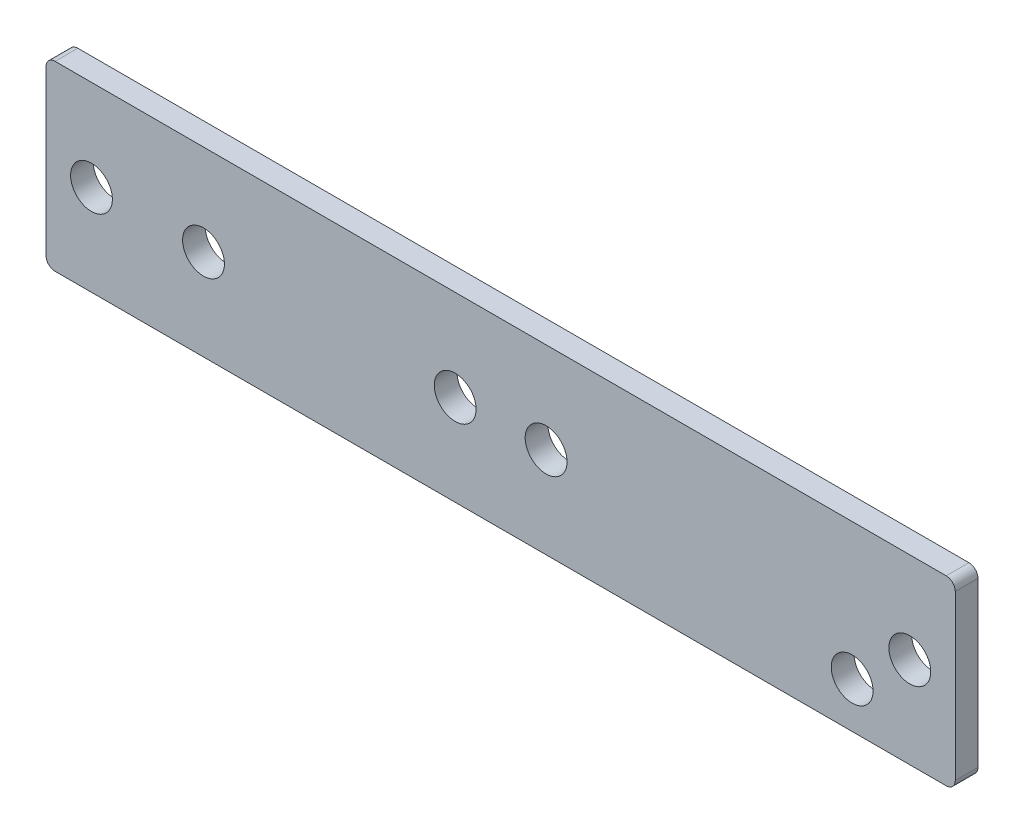
ISO-10303-21;
HEADER;
FILE_DESCRIPTION(('STEP AP214'),'2;1');
FILE_NAME('part.step','',(''),(''),'','','');
FILE_SCHEMA(('AUTOMOTIVE_DESIGN { 1 0 10303 214 1 1 1 1 }'));
ENDSEC;
DATA;
#1=APPLICATION_CONTEXT('core data for automotive mechanical design processes');
#2=APPLICATION_PROTOCOL_DEFINITION('international standard','automotive_design',2000,#1);
#3=PRODUCT_CONTEXT('',#1,'mechanical');
#4=PRODUCT('Part','Part','',(#3));
#5=PRODUCT_RELATED_PRODUCT_CATEGORY('part','',(#4));
#6=PRODUCT_DEFINITION_FORMATION('','',#4);
#7=PRODUCT_DEFINITION_CONTEXT('part definition',#1,'design');
#8=PRODUCT_DEFINITION('design','',#6,#7);
#9=PRODUCT_DEFINITION_SHAPE('','',#8);
#10=(LENGTH_UNIT() NAMED_UNIT(*) SI_UNIT(.MILLI.,.METRE.));
#11=(NAMED_UNIT(*) PLANE_ANGLE_UNIT() SI_UNIT($,.RADIAN.));
#12=(NAMED_UNIT(*) SI_UNIT($,.STERADIAN.) SOLID_ANGLE_UNIT());
#13=UNCERTAINTY_MEASURE_WITH_UNIT(LENGTH_MEASURE(1.E-05),#10,'distance_accuracy_value','');
#14=(GEOMETRIC_REPRESENTATION_CONTEXT(3) GLOBAL_UNCERTAINTY_ASSIGNED_CONTEXT((#13)) GLOBAL_UNIT_ASSIGNED_CONTEXT((#10,
#11,#12)) REPRESENTATION_CONTEXT('',''));
#15=CARTESIAN_POINT('',(0.,0.,0.));
#16=DIRECTION('',(0.,0.,1.));
#17=DIRECTION('',(1.,0.,0.));
#18=AXIS2_PLACEMENT_3D('',#15,#16,#17);
#19=CARTESIAN_POINT('',(-100.,20.,5.));
#20=DIRECTION('',(1.,0.,0.));
#21=DIRECTION('',(0.,1.,0.));
#22=AXIS2_PLACEMENT_3D('',#19,#20,#21);
#23=PLANE('',#22);
#24=DIRECTION('',(0.,-1.,0.));
#25=VECTOR('',#24,1.);
#26=CARTESIAN_POINT('',(-100.,20.,5.));
#27=LINE('',#26,#25);
#28=CARTESIAN_POINT('',(-100.,18.,5.));
#29=VERTEX_POINT('',#28);
#30=CARTESIAN_POINT('',(-100.,-18.,5.));
#31=VERTEX_POINT('',#30);
#32=EDGE_CURVE('E110',#29,#31,#27,.T.);
#33=ORIENTED_EDGE('',*,*,#32,.F.);
#34=DIRECTION('',(0.,0.,-1.));
#35=VECTOR('',#34,1.);
#36=CARTESIAN_POINT('',(-100.,18.,5.));
#37=LINE('',#36,#35);
#38=CARTESIAN_POINT('',(-100.,18.,0.));
#39=VERTEX_POINT('',#38);
#40=EDGE_CURVE('E10',#29,#39,#37,.T.);
#41=ORIENTED_EDGE('',*,*,#40,.T.);
#42=DIRECTION('',(0.,-1.,0.));
#43=VECTOR('',#42,1.);
#44=CARTESIAN_POINT('',(-100.,20.,0.));
#45=LINE('',#44,#43);
#46=CARTESIAN_POINT('',(-100.,-18.,0.));
#47=VERTEX_POINT('',#46);
#48=EDGE_CURVE('E141',#39,#47,#45,.T.);
#49=ORIENTED_EDGE('',*,*,#48,.T.);
#50=DIRECTION('',(0.,0.,-1.));
#51=VECTOR('',#50,1.);
#52=CARTESIAN_POINT('',(-100.,-18.,5.));
#53=LINE('',#52,#51);
#54=EDGE_CURVE('E24',#47,#31,#53,.F.);
#55=ORIENTED_EDGE('',*,*,#54,.T.);
#56=EDGE_LOOP('',(#33,#41,#49,#55));
#57=FACE_BOUND('',#56,.T.);
#58=ADVANCED_FACE('F16',(#57),#23,.F.);
#59=CARTESIAN_POINT('',(-100.,-20.,5.));
#60=DIRECTION('',(0.,1.,0.));
#61=DIRECTION('',(-1.,0.,0.));
#62=AXIS2_PLACEMENT_3D('',#59,#60,#61);
#63=PLANE('',#62);
#64=DIRECTION('',(1.,0.,0.));
#65=VECTOR('',#64,1.);
#66=CARTESIAN_POINT('',(-100.,-20.,0.));
#67=LINE('',#66,#65);
#68=CARTESIAN_POINT('',(-98.,-20.,0.));
#69=VERTEX_POINT('',#68);
#70=CARTESIAN_POINT('',(98.,-19.9999999999999,0.));
#71=VERTEX_POINT('',#70);
#72=EDGE_CURVE('E115',#69,#71,#67,.T.);
#73=ORIENTED_EDGE('',*,*,#72,.T.);
#74=DIRECTION('',(0.,0.,-1.));
#75=VECTOR('',#74,1.);
#76=CARTESIAN_POINT('',(98.,-19.9999999999999,5.));
#77=LINE('',#76,#75);
#78=CARTESIAN_POINT('',(98.,-19.9999999999999,5.));
#79=VERTEX_POINT('',#78);
#80=EDGE_CURVE('E31',#71,#79,#77,.F.);
#81=ORIENTED_EDGE('',*,*,#80,.T.);
#82=DIRECTION('',(1.,0.,0.));
#83=VECTOR('',#82,1.);
#84=CARTESIAN_POINT('',(-100.,-20.,5.));
#85=LINE('',#84,#83);
#86=CARTESIAN_POINT('',(-98.,-20.,5.));
#87=VERTEX_POINT('',#86);
#88=EDGE_CURVE('E113',#87,#79,#85,.T.);
#89=ORIENTED_EDGE('',*,*,#88,.F.);
#90=DIRECTION('',(0.,0.,-1.));
#91=VECTOR('',#90,1.);
#92=CARTESIAN_POINT('',(-98.,-20.,5.));
#93=LINE('',#92,#91);
#94=EDGE_CURVE('E133',#87,#69,#93,.T.);
#95=ORIENTED_EDGE('',*,*,#94,.T.);
#96=EDGE_LOOP('',(#73,#81,#89,#95));
#97=FACE_BOUND('',#96,.T.);
#98=ADVANCED_FACE('F148',(#97),#63,.F.);
#99=CARTESIAN_POINT('',(100.,20.,5.));
#100=DIRECTION('',(-1.,0.,0.));
#101=DIRECTION('',(0.,0.,1.));
#102=AXIS2_PLACEMENT_3D('',#99,#100,#101);
#103=PLANE('',#102);
#104=DIRECTION('',(0.,1.,0.));
#105=VECTOR('',#104,1.);
#106=CARTESIAN_POINT('',(100.,20.,0.));
#107=LINE('',#106,#105);
#108=CARTESIAN_POINT('',(100.,-18.,0.));
#109=VERTEX_POINT('',#108);
#110=CARTESIAN_POINT('',(100.,18.,0.));
#111=VERTEX_POINT('',#110);
#112=EDGE_CURVE('E111',#109,#111,#107,.T.);
#113=ORIENTED_EDGE('',*,*,#112,.T.);
#114=DIRECTION('',(0.,0.,-1.));
#115=VECTOR('',#114,1.);
#116=CARTESIAN_POINT('',(100.,18.,5.));
#117=LINE('',#116,#115);
#118=CARTESIAN_POINT('',(100.,18.,5.));
#119=VERTEX_POINT('',#118);
#120=EDGE_CURVE('E88',#111,#119,#117,.F.);
#121=ORIENTED_EDGE('',*,*,#120,.T.);
#122=DIRECTION('',(0.,1.,0.));
#123=VECTOR('',#122,1.);
#124=CARTESIAN_POINT('',(100.,20.,5.));
#125=LINE('',#124,#123);
#126=CARTESIAN_POINT('',(100.,-18.,5.));
#127=VERTEX_POINT('',#126);
#128=EDGE_CURVE('E153',#127,#119,#125,.T.);
#129=ORIENTED_EDGE('',*,*,#128,.F.);
#130=DIRECTION('',(0.,0.,-1.));
#131=VECTOR('',#130,1.);
#132=CARTESIAN_POINT('',(100.,-18.,5.));
#133=LINE('',#132,#131);
#134=EDGE_CURVE('E93',#127,#109,#133,.T.);
#135=ORIENTED_EDGE('',*,*,#134,.T.);
#136=EDGE_LOOP('',(#113,#121,#129,#135));
#137=FACE_BOUND('',#136,.T.);
#138=ADVANCED_FACE('F226',(#137),#103,.F.);
#139=CARTESIAN_POINT('',(-100.,20.,5.));
#140=DIRECTION('',(0.,-1.,0.));
#141=DIRECTION('',(1.,0.,0.));
#142=AXIS2_PLACEMENT_3D('',#139,#140,#141);
#143=PLANE('',#142);
#144=DIRECTION('',(-1.,0.,0.));
#145=VECTOR('',#144,1.);
#146=CARTESIAN_POINT('',(-100.,20.,5.));
#147=LINE('',#146,#145);
#148=CARTESIAN_POINT('',(98.,20.,5.));
#149=VERTEX_POINT('',#148);
#150=CARTESIAN_POINT('',(-98.,20.,5.));
#151=VERTEX_POINT('',#150);
#152=EDGE_CURVE('E103',#149,#151,#147,.T.);
#153=ORIENTED_EDGE('',*,*,#152,.F.);
#154=DIRECTION('',(0.,0.,-1.));
#155=VECTOR('',#154,1.);
#156=CARTESIAN_POINT('',(98.,20.,5.));
#157=LINE('',#156,#155);
#158=CARTESIAN_POINT('',(98.,20.,0.));
#159=VERTEX_POINT('',#158);
#160=EDGE_CURVE('E87',#149,#159,#157,.T.);
#161=ORIENTED_EDGE('',*,*,#160,.T.);
#162=DIRECTION('',(-1.,0.,0.));
#163=VECTOR('',#162,1.);
#164=CARTESIAN_POINT('',(-100.,20.,0.));
#165=LINE('',#164,#163);
#166=CARTESIAN_POINT('',(-98.,20.,0.));
#167=VERTEX_POINT('',#166);
#168=EDGE_CURVE('E100',#159,#167,#165,.T.);
#169=ORIENTED_EDGE('',*,*,#168,.T.);
#170=DIRECTION('',(0.,0.,-1.));
#171=VECTOR('',#170,1.);
#172=CARTESIAN_POINT('',(-98.,20.,5.));
#173=LINE('',#172,#171);
#174=EDGE_CURVE('E105',#167,#151,#173,.F.);
#175=ORIENTED_EDGE('',*,*,#174,.T.);
#176=EDGE_LOOP('',(#153,#161,#169,#175));
#177=FACE_BOUND('',#176,.T.);
#178=ADVANCED_FACE('F99',(#177),#143,.F.);
#179=CARTESIAN_POINT('',(0.,0.,5.));
#180=DIRECTION('',(0.,0.,1.));
#181=DIRECTION('',(1.,0.,0.));
#182=AXIS2_PLACEMENT_3D('',#179,#180,#181);
#183=PLANE('',#182);
#184=CARTESIAN_POINT('',(-9.99999999999999,0.,5.));
#185=DIRECTION('',(0.,0.,1.));
#186=DIRECTION('',(1.,0.,0.));
#187=AXIS2_PLACEMENT_3D('',#184,#185,#186);
#188=CIRCLE('',#187,4.6);
#189=CARTESIAN_POINT('',(-5.4,0.,5.));
#190=VERTEX_POINT('',#189);
#191=EDGE_CURVE('E184',#190,#190,#188,.T.);
#192=ORIENTED_EDGE('',*,*,#191,.F.);
#193=EDGE_LOOP('',(#192));
#194=FACE_BOUND('',#193,.T.);
#195=CARTESIAN_POINT('',(10.,0.,5.));
#196=DIRECTION('',(0.,0.,1.));
#197=DIRECTION('',(1.,0.,0.));
#198=AXIS2_PLACEMENT_3D('',#195,#196,#197);
#199=CIRCLE('',#198,4.6);
#200=CARTESIAN_POINT('',(14.6,0.,5.));
#201=VERTEX_POINT('',#200);
#202=EDGE_CURVE('E177',#201,#201,#199,.T.);
#203=ORIENTED_EDGE('',*,*,#202,.F.);
#204=EDGE_LOOP('',(#203));
#205=FACE_BOUND('',#204,.T.);
#206=CARTESIAN_POINT('',(90.,0.,5.));
#207=DIRECTION('',(0.,0.,1.));
#208=DIRECTION('',(1.,0.,0.));
#209=AXIS2_PLACEMENT_3D('',#206,#207,#208);
#210=CIRCLE('',#209,4.60000000000001);
#211=CARTESIAN_POINT('',(94.6,0.,5.));
#212=VERTEX_POINT('',#211);
#213=EDGE_CURVE('E178',#212,#212,#210,.T.);
#214=ORIENTED_EDGE('',*,*,#213,.F.);
#215=EDGE_LOOP('',(#214));
#216=FACE_BOUND('',#215,.T.);
#217=CARTESIAN_POINT('',(-90.,0.,5.));
#218=DIRECTION('',(0.,0.,1.));
#219=DIRECTION('',(1.,0.,0.));
#220=AXIS2_PLACEMENT_3D('',#217,#218,#219);
#221=CIRCLE('',#220,4.6);
#222=CARTESIAN_POINT('',(-85.4,0.,5.));
#223=VERTEX_POINT('',#222);
#224=EDGE_CURVE('E170',#223,#223,#221,.T.);
#225=ORIENTED_EDGE('',*,*,#224,.F.);
#226=EDGE_LOOP('',(#225));
#227=FACE_BOUND('',#226,.T.);
#228=CARTESIAN_POINT('',(77.3205080754251,-10.,5.));
#229=DIRECTION('',(0.,0.,1.));
#230=DIRECTION('',(1.,0.,0.));
#231=AXIS2_PLACEMENT_3D('',#228,#229,#230);
#232=CIRCLE('',#231,4.6);
#233=CARTESIAN_POINT('',(81.9205080754251,-10.,5.));
#234=VERTEX_POINT('',#233);
#235=EDGE_CURVE('E164',#234,#234,#232,.T.);
#236=ORIENTED_EDGE('',*,*,#235,.F.);
#237=EDGE_LOOP('',(#236));
#238=FACE_BOUND('',#237,.T.);
#239=CARTESIAN_POINT('',(-65.3589838486225,0.,5.));
#240=DIRECTION('',(0.,0.,1.));
#241=DIRECTION('',(1.,0.,0.));
#242=AXIS2_PLACEMENT_3D('',#239,#240,#241);
#243=CIRCLE('',#242,4.6);
#244=CARTESIAN_POINT('',(-60.7589838486225,0.,5.));
#245=VERTEX_POINT('',#244);
#246=EDGE_CURVE('E158',#245,#245,#243,.T.);
#247=ORIENTED_EDGE('',*,*,#246,.F.);
#248=EDGE_LOOP('',(#247));
#249=FACE_BOUND('',#248,.T.);
#250=ORIENTED_EDGE('',*,*,#128,.T.);
#251=CARTESIAN_POINT('',(98.,18.,5.));
#252=DIRECTION('',(0.,0.,1.));
#253=DIRECTION('',(1.,0.,0.));
#254=AXIS2_PLACEMENT_3D('',#251,#252,#253);
#255=CIRCLE('',#254,2.);
#256=EDGE_CURVE('E131',#119,#149,#255,.T.);
#257=ORIENTED_EDGE('',*,*,#256,.T.);
#258=ORIENTED_EDGE('',*,*,#152,.T.);
#259=CARTESIAN_POINT('',(-98.,18.,5.));
#260=DIRECTION('',(0.,0.,1.));
#261=DIRECTION('',(1.,0.,0.));
#262=AXIS2_PLACEMENT_3D('',#259,#260,#261);
#263=CIRCLE('',#262,2.);
#264=EDGE_CURVE('E127',#151,#29,#263,.T.);
#265=ORIENTED_EDGE('',*,*,#264,.T.);
#266=ORIENTED_EDGE('',*,*,#32,.T.);
#267=CARTESIAN_POINT('',(-98.,-18.,5.));
#268=DIRECTION('',(0.,0.,1.));
#269=DIRECTION('',(1.,0.,0.));
#270=AXIS2_PLACEMENT_3D('',#267,#268,#269);
#271=CIRCLE('',#270,2.);
#272=EDGE_CURVE('E38',#31,#87,#271,.T.);
#273=ORIENTED_EDGE('',*,*,#272,.T.);
#274=ORIENTED_EDGE('',*,*,#88,.T.);
#275=CARTESIAN_POINT('',(98.,-18.,5.));
#276=DIRECTION('',(0.,0.,1.));
#277=DIRECTION('',(1.,0.,0.));
#278=AXIS2_PLACEMENT_3D('',#275,#276,#277);
#279=CIRCLE('',#278,2.);
#280=EDGE_CURVE('E129',#79,#127,#279,.T.);
#281=ORIENTED_EDGE('',*,*,#280,.T.);
#282=EDGE_LOOP('',(#250,#257,#258,#265,#266,#273,#274,#281));
#283=FACE_BOUND('',#282,.T.);
#284=ADVANCED_FACE('F144',(#194,#205,#216,#227,#238,#249,#283),#183,.T.);
#285=CARTESIAN_POINT('',(0.,0.,0.));
#286=DIRECTION('',(0.,0.,1.));
#287=DIRECTION('',(1.,0.,0.));
#288=AXIS2_PLACEMENT_3D('',#285,#286,#287);
#289=PLANE('',#288);
#290=CARTESIAN_POINT('',(-9.99999999999999,0.,0.));
#291=DIRECTION('',(0.,0.,1.));
#292=DIRECTION('',(1.,0.,0.));
#293=AXIS2_PLACEMENT_3D('',#290,#291,#292);
#294=CIRCLE('',#293,4.6);
#295=CARTESIAN_POINT('',(-5.4,0.,0.));
#296=VERTEX_POINT('',#295);
#297=EDGE_CURVE('E173',#296,#296,#294,.F.);
#298=ORIENTED_EDGE('',*,*,#297,.F.);
#299=EDGE_LOOP('',(#298));
#300=FACE_BOUND('',#299,.T.);
#301=CARTESIAN_POINT('',(10.,0.,0.));
#302=DIRECTION('',(0.,0.,1.));
#303=DIRECTION('',(1.,0.,0.));
#304=AXIS2_PLACEMENT_3D('',#301,#302,#303);
#305=CIRCLE('',#304,4.6);
#306=CARTESIAN_POINT('',(14.6,0.,0.));
#307=VERTEX_POINT('',#306);
#308=EDGE_CURVE('E181',#307,#307,#305,.F.);
#309=ORIENTED_EDGE('',*,*,#308,.F.);
#310=EDGE_LOOP('',(#309));
#311=FACE_BOUND('',#310,.T.);
#312=CARTESIAN_POINT('',(90.,0.,0.));
#313=DIRECTION('',(0.,0.,1.));
#314=DIRECTION('',(1.,0.,0.));
#315=AXIS2_PLACEMENT_3D('',#312,#313,#314);
#316=CIRCLE('',#315,4.60000000000001);
#317=CARTESIAN_POINT('',(94.6,0.,0.));
#318=VERTEX_POINT('',#317);
#319=EDGE_CURVE('E174',#318,#318,#316,.F.);
#320=ORIENTED_EDGE('',*,*,#319,.F.);
#321=EDGE_LOOP('',(#320));
#322=FACE_BOUND('',#321,.T.);
#323=CARTESIAN_POINT('',(-90.,0.,0.));
#324=DIRECTION('',(0.,0.,1.));
#325=DIRECTION('',(1.,0.,0.));
#326=AXIS2_PLACEMENT_3D('',#323,#324,#325);
#327=CIRCLE('',#326,4.6);
#328=CARTESIAN_POINT('',(-85.4,0.,0.));
#329=VERTEX_POINT('',#328);
#330=EDGE_CURVE('E167',#329,#329,#327,.F.);
#331=ORIENTED_EDGE('',*,*,#330,.F.);
#332=EDGE_LOOP('',(#331));
#333=FACE_BOUND('',#332,.T.);
#334=CARTESIAN_POINT('',(77.3205080754251,-10.,0.));
#335=DIRECTION('',(0.,0.,1.));
#336=DIRECTION('',(1.,0.,0.));
#337=AXIS2_PLACEMENT_3D('',#334,#335,#336);
#338=CIRCLE('',#337,4.6);
#339=CARTESIAN_POINT('',(81.9205080754251,-10.,0.));
#340=VERTEX_POINT('',#339);
#341=EDGE_CURVE('E161',#340,#340,#338,.F.);
#342=ORIENTED_EDGE('',*,*,#341,.F.);
#343=EDGE_LOOP('',(#342));
#344=FACE_BOUND('',#343,.T.);
#345=CARTESIAN_POINT('',(-65.3589838486225,0.,0.));
#346=DIRECTION('',(0.,0.,1.));
#347=DIRECTION('',(1.,0.,0.));
#348=AXIS2_PLACEMENT_3D('',#345,#346,#347);
#349=CIRCLE('',#348,4.6);
#350=CARTESIAN_POINT('',(-60.7589838486225,0.,0.));
#351=VERTEX_POINT('',#350);
#352=EDGE_CURVE('E149',#351,#351,#349,.F.);
#353=ORIENTED_EDGE('',*,*,#352,.F.);
#354=EDGE_LOOP('',(#353));
#355=FACE_BOUND('',#354,.T.);
#356=ORIENTED_EDGE('',*,*,#168,.F.);
#357=CARTESIAN_POINT('',(98.,18.,0.));
#358=DIRECTION('',(0.,0.,1.));
#359=DIRECTION('',(1.,0.,0.));
#360=AXIS2_PLACEMENT_3D('',#357,#358,#359);
#361=CIRCLE('',#360,2.);
#362=EDGE_CURVE('E83',#159,#111,#361,.F.);
#363=ORIENTED_EDGE('',*,*,#362,.T.);
#364=ORIENTED_EDGE('',*,*,#112,.F.);
#365=CARTESIAN_POINT('',(98.,-18.,0.));
#366=DIRECTION('',(0.,0.,1.));
#367=DIRECTION('',(1.,0.,0.));
#368=AXIS2_PLACEMENT_3D('',#365,#366,#367);
#369=CIRCLE('',#368,2.);
#370=EDGE_CURVE('E94',#109,#71,#369,.F.);
#371=ORIENTED_EDGE('',*,*,#370,.T.);
#372=ORIENTED_EDGE('',*,*,#72,.F.);
#373=CARTESIAN_POINT('',(-98.,-18.,0.));
#374=DIRECTION('',(0.,0.,1.));
#375=DIRECTION('',(1.,0.,0.));
#376=AXIS2_PLACEMENT_3D('',#373,#374,#375);
#377=CIRCLE('',#376,2.);
#378=EDGE_CURVE('E104',#69,#47,#377,.F.);
#379=ORIENTED_EDGE('',*,*,#378,.T.);
#380=ORIENTED_EDGE('',*,*,#48,.F.);
#381=CARTESIAN_POINT('',(-98.,18.,0.));
#382=DIRECTION('',(0.,0.,1.));
#383=DIRECTION('',(1.,0.,0.));
#384=AXIS2_PLACEMENT_3D('',#381,#382,#383);
#385=CIRCLE('',#384,2.);
#386=EDGE_CURVE('E109',#39,#167,#385,.F.);
#387=ORIENTED_EDGE('',*,*,#386,.T.);
#388=EDGE_LOOP('',(#356,#363,#364,#371,#372,#379,#380,#387));
#389=FACE_BOUND('',#388,.T.);
#390=ADVANCED_FACE('F107',(#300,#311,#322,#333,#344,#355,#389),#289,.F.);
#391=CARTESIAN_POINT('',(-65.3589838486225,0.,-13.0107647738325));
#392=DIRECTION('',(0.,0.,1.));
#393=DIRECTION('',(1.,0.,0.));
#394=AXIS2_PLACEMENT_3D('',#391,#392,#393);
#395=CYLINDRICAL_SURFACE('',#394,4.6);
#396=ORIENTED_EDGE('',*,*,#352,.T.);
#397=EDGE_LOOP('',(#396));
#398=FACE_BOUND('',#397,.T.);
#399=ORIENTED_EDGE('',*,*,#246,.T.);
#400=EDGE_LOOP('',(#399));
#401=FACE_BOUND('',#400,.T.);
#402=ADVANCED_FACE('F207',(#398,#401),#395,.F.);
#403=CARTESIAN_POINT('',(77.3205080754251,-10.,-13.0107647738325));
#404=DIRECTION('',(0.,0.,1.));
#405=DIRECTION('',(1.,0.,0.));
#406=AXIS2_PLACEMENT_3D('',#403,#404,#405);
#407=CYLINDRICAL_SURFACE('',#406,4.6);
#408=ORIENTED_EDGE('',*,*,#341,.T.);
#409=EDGE_LOOP('',(#408));
#410=FACE_BOUND('',#409,.T.);
#411=ORIENTED_EDGE('',*,*,#235,.T.);
#412=EDGE_LOOP('',(#411));
#413=FACE_BOUND('',#412,.T.);
#414=ADVANCED_FACE('F209',(#410,#413),#407,.F.);
#415=CARTESIAN_POINT('',(98.,18.,5.));
#416=DIRECTION('',(0.,0.,-1.));
#417=DIRECTION('',(-1.,0.,0.));
#418=AXIS2_PLACEMENT_3D('',#415,#416,#417);
#419=CYLINDRICAL_SURFACE('',#418,2.);
#420=ORIENTED_EDGE('',*,*,#256,.F.);
#421=ORIENTED_EDGE('',*,*,#120,.F.);
#422=ORIENTED_EDGE('',*,*,#362,.F.);
#423=ORIENTED_EDGE('',*,*,#160,.F.);
#424=EDGE_LOOP('',(#420,#421,#422,#423));
#425=FACE_BOUND('',#424,.T.);
#426=ADVANCED_FACE('F86',(#425),#419,.T.);
#427=CARTESIAN_POINT('',(98.,-18.,5.));
#428=DIRECTION('',(0.,0.,-1.));
#429=DIRECTION('',(-1.,0.,0.));
#430=AXIS2_PLACEMENT_3D('',#427,#428,#429);
#431=CYLINDRICAL_SURFACE('',#430,2.);
#432=ORIENTED_EDGE('',*,*,#280,.F.);
#433=ORIENTED_EDGE('',*,*,#80,.F.);
#434=ORIENTED_EDGE('',*,*,#370,.F.);
#435=ORIENTED_EDGE('',*,*,#134,.F.);
#436=EDGE_LOOP('',(#432,#433,#434,#435));
#437=FACE_BOUND('',#436,.T.);
#438=ADVANCED_FACE('F232',(#437),#431,.T.);
#439=CARTESIAN_POINT('',(-98.,18.,5.));
#440=DIRECTION('',(0.,0.,-1.));
#441=DIRECTION('',(-1.,0.,0.));
#442=AXIS2_PLACEMENT_3D('',#439,#440,#441);
#443=CYLINDRICAL_SURFACE('',#442,2.);
#444=ORIENTED_EDGE('',*,*,#264,.F.);
#445=ORIENTED_EDGE('',*,*,#174,.F.);
#446=ORIENTED_EDGE('',*,*,#386,.F.);
#447=ORIENTED_EDGE('',*,*,#40,.F.);
#448=EDGE_LOOP('',(#444,#445,#446,#447));
#449=FACE_BOUND('',#448,.T.);
#450=ADVANCED_FACE('F234',(#449),#443,.T.);
#451=CARTESIAN_POINT('',(-98.,-18.,5.));
#452=DIRECTION('',(0.,0.,-1.));
#453=DIRECTION('',(-1.,0.,0.));
#454=AXIS2_PLACEMENT_3D('',#451,#452,#453);
#455=CYLINDRICAL_SURFACE('',#454,2.);
#456=ORIENTED_EDGE('',*,*,#272,.F.);
#457=ORIENTED_EDGE('',*,*,#54,.F.);
#458=ORIENTED_EDGE('',*,*,#378,.F.);
#459=ORIENTED_EDGE('',*,*,#94,.F.);
#460=EDGE_LOOP('',(#456,#457,#458,#459));
#461=FACE_BOUND('',#460,.T.);
#462=ADVANCED_FACE('F18',(#461),#455,.T.);
#463=CARTESIAN_POINT('',(-90.,0.,-13.0107647738325));
#464=DIRECTION('',(0.,0.,1.));
#465=DIRECTION('',(1.,0.,0.));
#466=AXIS2_PLACEMENT_3D('',#463,#464,#465);
#467=CYLINDRICAL_SURFACE('',#466,4.6);
#468=ORIENTED_EDGE('',*,*,#330,.T.);
#469=EDGE_LOOP('',(#468));
#470=FACE_BOUND('',#469,.T.);
#471=ORIENTED_EDGE('',*,*,#224,.T.);
#472=EDGE_LOOP('',(#471));
#473=FACE_BOUND('',#472,.T.);
#474=ADVANCED_FACE('F241',(#470,#473),#467,.F.);
#475=CARTESIAN_POINT('',(90.,0.,-13.0107647738325));
#476=DIRECTION('',(0.,0.,1.));
#477=DIRECTION('',(1.,0.,0.));
#478=AXIS2_PLACEMENT_3D('',#475,#476,#477);
#479=CYLINDRICAL_SURFACE('',#478,4.60000000000001);
#480=ORIENTED_EDGE('',*,*,#319,.T.);
#481=EDGE_LOOP('',(#480));
#482=FACE_BOUND('',#481,.T.);
#483=ORIENTED_EDGE('',*,*,#213,.T.);
#484=EDGE_LOOP('',(#483));
#485=FACE_BOUND('',#484,.T.);
#486=ADVANCED_FACE('F313',(#482,#485),#479,.F.);
#487=CARTESIAN_POINT('',(10.,0.,-13.0107647738325));
#488=DIRECTION('',(0.,0.,1.));
#489=DIRECTION('',(1.,0.,0.));
#490=AXIS2_PLACEMENT_3D('',#487,#488,#489);
#491=CYLINDRICAL_SURFACE('',#490,4.6);
#492=ORIENTED_EDGE('',*,*,#308,.T.);
#493=EDGE_LOOP('',(#492));
#494=FACE_BOUND('',#493,.T.);
#495=ORIENTED_EDGE('',*,*,#202,.T.);
#496=EDGE_LOOP('',(#495));
#497=FACE_BOUND('',#496,.T.);
#498=ADVANCED_FACE('F323',(#494,#497),#491,.F.);
#499=CARTESIAN_POINT('',(-9.99999999999999,0.,-13.0107647738325));
#500=DIRECTION('',(0.,0.,1.));
#501=DIRECTION('',(1.,0.,0.));
#502=AXIS2_PLACEMENT_3D('',#499,#500,#501);
#503=CYLINDRICAL_SURFACE('',#502,4.6);
#504=ORIENTED_EDGE('',*,*,#297,.T.);
#505=EDGE_LOOP('',(#504));
#506=FACE_BOUND('',#505,.T.);
#507=ORIENTED_EDGE('',*,*,#191,.T.);
#508=EDGE_LOOP('',(#507));
#509=FACE_BOUND('',#508,.T.);
#510=ADVANCED_FACE('F192',(#506,#509),#503,.F.);
#511=CLOSED_SHELL('',(#58,#98,#138,#178,#284,#390,#402,#414,#426,#438,#450,#462,#474,#486,#498,#510));
#512=MANIFOLD_SOLID_BREP('B1',#511);
#513=ADVANCED_BREP_SHAPE_REPRESENTATION('',(#18,#512),#14);
#514=SHAPE_DEFINITION_REPRESENTATION(#9,#513);
ENDSEC;
END-ISO-10303-21;
